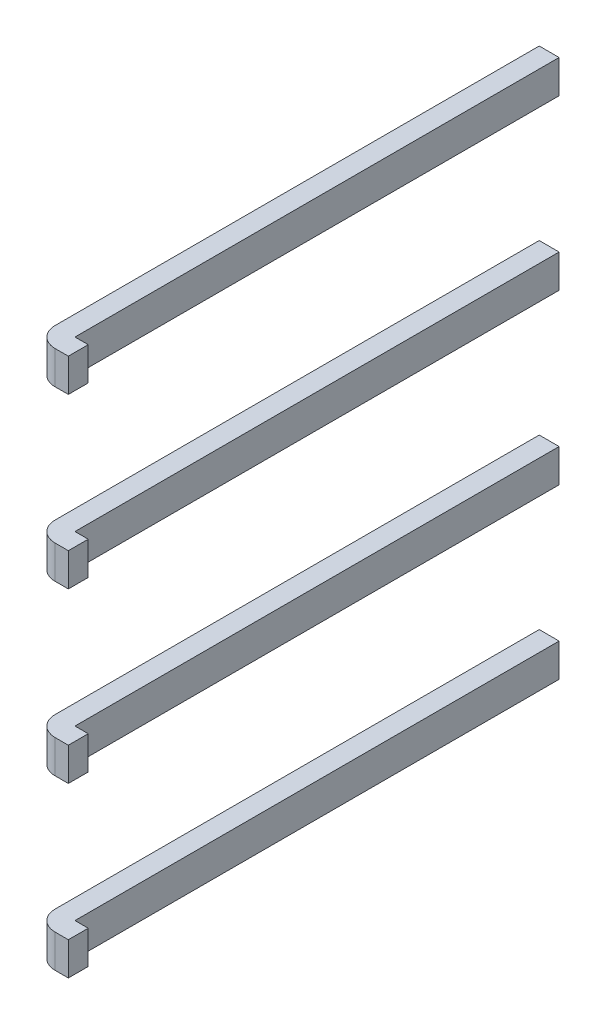
ISO-10303-21;
HEADER;
FILE_DESCRIPTION(('STEP AP214'),'2;1');
FILE_NAME('part.step','',(''),(''),'','','');
FILE_SCHEMA(('AUTOMOTIVE_DESIGN { 1 0 10303 214 1 1 1 1 }'));
ENDSEC;
DATA;
#1=APPLICATION_CONTEXT('core data for automotive mechanical design processes');
#2=APPLICATION_PROTOCOL_DEFINITION('international standard','automotive_design',2000,#1);
#3=PRODUCT_CONTEXT('',#1,'mechanical');
#4=PRODUCT('Part','Part','',(#3));
#5=PRODUCT_RELATED_PRODUCT_CATEGORY('part','',(#4));
#6=PRODUCT_DEFINITION_FORMATION('','',#4);
#7=PRODUCT_DEFINITION_CONTEXT('part definition',#1,'design');
#8=PRODUCT_DEFINITION('design','',#6,#7);
#9=PRODUCT_DEFINITION_SHAPE('','',#8);
#10=(LENGTH_UNIT() NAMED_UNIT(*) SI_UNIT(.MILLI.,.METRE.));
#11=(NAMED_UNIT(*) PLANE_ANGLE_UNIT() SI_UNIT($,.RADIAN.));
#12=(NAMED_UNIT(*) SI_UNIT($,.STERADIAN.) SOLID_ANGLE_UNIT());
#13=UNCERTAINTY_MEASURE_WITH_UNIT(LENGTH_MEASURE(1.E-05),#10,'distance_accuracy_value','');
#14=(GEOMETRIC_REPRESENTATION_CONTEXT(3) GLOBAL_UNCERTAINTY_ASSIGNED_CONTEXT((#13)) GLOBAL_UNIT_ASSIGNED_CONTEXT((#10,
#11,#12)) REPRESENTATION_CONTEXT('',''));
#15=CARTESIAN_POINT('',(0.,0.,0.));
#16=DIRECTION('',(0.,0.,1.));
#17=DIRECTION('',(1.,0.,0.));
#18=AXIS2_PLACEMENT_3D('',#15,#16,#17);
#19=CARTESIAN_POINT('',(-8.,1.27,3.2));
#20=DIRECTION('',(0.,1.034727858951E-13,-1.));
#21=DIRECTION('',(0.,1.,1.034727858951E-13));
#22=AXIS2_PLACEMENT_3D('',#19,#20,#21);
#23=PLANE('',#22);
#24=DIRECTION('',(1.,0.,0.));
#25=VECTOR('',#24,1.);
#26=CARTESIAN_POINT('',(-8.34012345679,0.769999999999616,3.2));
#27=LINE('',#26,#25);
#28=CARTESIAN_POINT('',(-8.,0.769999999999616,3.2));
#29=VERTEX_POINT('',#28);
#30=CARTESIAN_POINT('',(-8.2,0.769999999999793,3.19999999999996));
#31=VERTEX_POINT('',#30);
#32=EDGE_CURVE('P0_E118',#29,#31,#27,.F.);
#33=ORIENTED_EDGE('',*,*,#32,.F.);
#34=DIRECTION('',(0.,1.,0.));
#35=VECTOR('',#34,1.);
#36=CARTESIAN_POINT('',(-8.,1.27,3.2));
#37=LINE('',#36,#35);
#38=CARTESIAN_POINT('',(-8.,1.26999999999974,3.2));
#39=VERTEX_POINT('',#38);
#40=EDGE_CURVE('P0_E94',#29,#39,#37,.T.);
#41=ORIENTED_EDGE('',*,*,#40,.T.);
#42=DIRECTION('',(1.,0.,0.));
#43=VECTOR('',#42,1.);
#44=CARTESIAN_POINT('',(-8.34012345679,1.26999999999962,3.2));
#45=LINE('',#44,#43);
#46=CARTESIAN_POINT('',(-8.2,1.26999999999981,3.2));
#47=VERTEX_POINT('',#46);
#48=EDGE_CURVE('P0_E67',#39,#47,#45,.F.);
#49=ORIENTED_EDGE('',*,*,#48,.T.);
#50=DIRECTION('',(0.,-1.,-1.034727858951E-13));
#51=VECTOR('',#50,1.);
#52=CARTESIAN_POINT('',(-8.2,1.26999999999997,3.2));
#53=LINE('',#52,#51);
#54=EDGE_CURVE('P0_E103',#31,#47,#53,.F.);
#55=ORIENTED_EDGE('',*,*,#54,.F.);
#56=EDGE_LOOP('',(#33,#41,#49,#55));
#57=FACE_BOUND('',#56,.T.);
#58=ADVANCED_FACE('P0_F16',(#57),#23,.F.);
#59=CARTESIAN_POINT('',(-8.2,1.27,-4.4));
#60=DIRECTION('',(-1.,0.,0.));
#61=DIRECTION('',(0.,0.,1.));
#62=AXIS2_PLACEMENT_3D('',#59,#60,#61);
#63=PLANE('',#62);
#64=DIRECTION('',(0.,-1.,-1.034727858951E-13));
#65=VECTOR('',#64,1.);
#66=CARTESIAN_POINT('',(-8.2,1.27,2.9));
#67=LINE('',#66,#65);
#68=CARTESIAN_POINT('',(-8.2,1.26999999999977,2.9));
#69=VERTEX_POINT('',#68);
#70=CARTESIAN_POINT('',(-8.2,0.769999999999647,2.89999999999998));
#71=VERTEX_POINT('',#70);
#72=EDGE_CURVE('P0_E95',#69,#71,#67,.T.);
#73=ORIENTED_EDGE('',*,*,#72,.T.);
#74=DIRECTION('',(0.,1.034762911095E-13,-1.));
#75=VECTOR('',#74,1.);
#76=CARTESIAN_POINT('',(-8.2,0.77,-0.50987654321));
#77=LINE('',#76,#75);
#78=CARTESIAN_POINT('',(-8.2,0.770000000000134,-4.40000000000003));
#79=VERTEX_POINT('',#78);
#80=EDGE_CURVE('P0_E86',#79,#71,#77,.F.);
#81=ORIENTED_EDGE('',*,*,#80,.F.);
#82=DIRECTION('',(0.,1.,0.));
#83=VECTOR('',#82,1.);
#84=CARTESIAN_POINT('',(-8.2,1.27,-4.4));
#85=LINE('',#84,#83);
#86=CARTESIAN_POINT('',(-8.2,1.27000000000013,-4.4));
#87=VERTEX_POINT('',#86);
#88=EDGE_CURVE('P0_E155',#87,#79,#85,.F.);
#89=ORIENTED_EDGE('',*,*,#88,.F.);
#90=DIRECTION('',(0.,1.034762911095E-13,-1.));
#91=VECTOR('',#90,1.);
#92=CARTESIAN_POINT('',(-8.2,1.27,-0.50987654321));
#93=LINE('',#92,#91);
#94=EDGE_CURVE('P0_E112',#87,#69,#93,.F.);
#95=ORIENTED_EDGE('',*,*,#94,.T.);
#96=EDGE_LOOP('',(#73,#81,#89,#95));
#97=FACE_BOUND('',#96,.T.);
#98=ADVANCED_FACE('P0_F163',(#97),#63,.F.);
#99=CARTESIAN_POINT('',(-8.2,1.27,2.9));
#100=DIRECTION('',(0.,-1.034727858951E-13,1.));
#101=DIRECTION('',(0.,-1.,-1.034727858951E-13));
#102=AXIS2_PLACEMENT_3D('',#99,#100,#101);
#103=PLANE('',#102);
#104=DIRECTION('',(0.,1.,0.));
#105=VECTOR('',#104,1.);
#106=CARTESIAN_POINT('',(-8.,1.27,2.9));
#107=LINE('',#106,#105);
#108=CARTESIAN_POINT('',(-8.,1.26999999999991,2.9));
#109=VERTEX_POINT('',#108);
#110=CARTESIAN_POINT('',(-8.,0.769999999999912,2.89999999999997));
#111=VERTEX_POINT('',#110);
#112=EDGE_CURVE('P0_E74',#109,#111,#107,.F.);
#113=ORIENTED_EDGE('',*,*,#112,.T.);
#114=DIRECTION('',(1.,0.,0.));
#115=VECTOR('',#114,1.);
#116=CARTESIAN_POINT('',(-8.34012345679,0.769999999999647,2.9));
#117=LINE('',#116,#115);
#118=EDGE_CURVE('P0_E81',#71,#111,#117,.T.);
#119=ORIENTED_EDGE('',*,*,#118,.F.);
#120=ORIENTED_EDGE('',*,*,#72,.F.);
#121=DIRECTION('',(1.,0.,0.));
#122=VECTOR('',#121,1.);
#123=CARTESIAN_POINT('',(-8.34012345679,1.26999999999965,2.9));
#124=LINE('',#123,#122);
#125=EDGE_CURVE('P0_E93',#69,#109,#124,.T.);
#126=ORIENTED_EDGE('',*,*,#125,.T.);
#127=EDGE_LOOP('',(#113,#119,#120,#126));
#128=FACE_BOUND('',#127,.T.);
#129=ADVANCED_FACE('P0_F91',(#128),#103,.F.);
#130=CARTESIAN_POINT('',(-8.,1.27,2.9));
#131=DIRECTION('',(-1.,0.,0.));
#132=DIRECTION('',(0.,0.,1.));
#133=AXIS2_PLACEMENT_3D('',#130,#131,#132);
#134=PLANE('',#133);
#135=ORIENTED_EDGE('',*,*,#40,.F.);
#136=DIRECTION('',(0.,1.034762911095E-13,-1.));
#137=VECTOR('',#136,1.);
#138=CARTESIAN_POINT('',(-8.,0.77,-0.50987654321));
#139=LINE('',#138,#137);
#140=EDGE_CURVE('P0_E83',#111,#29,#139,.F.);
#141=ORIENTED_EDGE('',*,*,#140,.F.);
#142=ORIENTED_EDGE('',*,*,#112,.F.);
#143=DIRECTION('',(0.,1.034762911095E-13,-1.));
#144=VECTOR('',#143,1.);
#145=CARTESIAN_POINT('',(-8.,1.27,-0.50987654321));
#146=LINE('',#145,#144);
#147=EDGE_CURVE('P0_E111',#109,#39,#146,.F.);
#148=ORIENTED_EDGE('',*,*,#147,.T.);
#149=EDGE_LOOP('',(#135,#141,#142,#148));
#150=FACE_BOUND('',#149,.T.);
#151=ADVANCED_FACE('P0_F97',(#150),#134,.F.);
#152=CARTESIAN_POINT('',(-8.34012345679,1.27,-0.50987654321));
#153=DIRECTION('',(0.,-1.,-1.034762911095E-13));
#154=DIRECTION('',(0.,1.034762911095E-13,-1.));
#155=AXIS2_PLACEMENT_3D('',#152,#153,#154);
#156=PLANE('',#155);
#157=ORIENTED_EDGE('',*,*,#125,.F.);
#158=ORIENTED_EDGE('',*,*,#94,.F.);
#159=DIRECTION('',(1.,0.,0.));
#160=VECTOR('',#159,1.);
#161=CARTESIAN_POINT('',(-8.5,1.27,-4.4));
#162=LINE('',#161,#160);
#163=CARTESIAN_POINT('',(-8.5,1.27,-4.4));
#164=VERTEX_POINT('',#163);
#165=EDGE_CURVE('P0_E99',#87,#164,#162,.F.);
#166=ORIENTED_EDGE('',*,*,#165,.T.);
#167=DIRECTION('',(0.,0.,-1.));
#168=VECTOR('',#167,1.);
#169=CARTESIAN_POINT('',(-8.5,1.27,3.2));
#170=LINE('',#169,#168);
#171=CARTESIAN_POINT('',(-8.5,1.27000000000002,2.9));
#172=VERTEX_POINT('',#171);
#173=EDGE_CURVE('P0_E130',#164,#172,#170,.F.);
#174=ORIENTED_EDGE('',*,*,#173,.T.);
#175=CARTESIAN_POINT('',(-8.2,1.27000000000003,2.9));
#176=DIRECTION('',(0.,-1.,-1.034727858951E-13));
#177=DIRECTION('',(0.,1.034727858951E-13,-1.));
#178=AXIS2_PLACEMENT_3D('',#175,#176,#177);
#179=CIRCLE('',#178,0.3);
#180=EDGE_CURVE('P0_E19',#47,#172,#179,.T.);
#181=ORIENTED_EDGE('',*,*,#180,.F.);
#182=ORIENTED_EDGE('',*,*,#48,.F.);
#183=ORIENTED_EDGE('',*,*,#147,.F.);
#184=EDGE_LOOP('',(#157,#158,#166,#174,#181,#182,#183));
#185=FACE_BOUND('',#184,.T.);
#186=ADVANCED_FACE('P0_F166',(#185),#156,.F.);
#187=CARTESIAN_POINT('',(-8.2,1.27,2.9));
#188=DIRECTION('',(0.,-1.,-1.034727858951E-13));
#189=DIRECTION('',(0.,1.034727858951E-13,-1.));
#190=AXIS2_PLACEMENT_3D('',#187,#188,#189);
#191=CYLINDRICAL_SURFACE('',#190,0.3);
#192=CARTESIAN_POINT('',(-8.2,0.77,2.89999999999995));
#193=DIRECTION('',(0.,-1.,-1.034727858951E-13));
#194=DIRECTION('',(0.,1.034727858951E-13,-1.));
#195=AXIS2_PLACEMENT_3D('',#192,#193,#194);
#196=CIRCLE('',#195,0.3);
#197=CARTESIAN_POINT('',(-8.5,0.77,2.89999999999997));
#198=VERTEX_POINT('',#197);
#199=EDGE_CURVE('P0_E117',#31,#198,#196,.T.);
#200=ORIENTED_EDGE('',*,*,#199,.F.);
#201=ORIENTED_EDGE('',*,*,#54,.T.);
#202=ORIENTED_EDGE('',*,*,#180,.T.);
#203=DIRECTION('',(0.,1.,0.));
#204=VECTOR('',#203,1.);
#205=CARTESIAN_POINT('',(-8.5,1.27,2.9));
#206=LINE('',#205,#204);
#207=EDGE_CURVE('P0_E127',#172,#198,#206,.F.);
#208=ORIENTED_EDGE('',*,*,#207,.T.);
#209=EDGE_LOOP('',(#200,#201,#202,#208));
#210=FACE_BOUND('',#209,.T.);
#211=ADVANCED_FACE('P0_F171',(#210),#191,.T.);
#212=CARTESIAN_POINT('',(-8.34012345679,0.77,-0.50987654321));
#213=DIRECTION('',(0.,-1.,-1.034762911095E-13));
#214=DIRECTION('',(0.,1.034762911095E-13,-1.));
#215=AXIS2_PLACEMENT_3D('',#212,#213,#214);
#216=PLANE('',#215);
#217=ORIENTED_EDGE('',*,*,#118,.T.);
#218=ORIENTED_EDGE('',*,*,#140,.T.);
#219=ORIENTED_EDGE('',*,*,#32,.T.);
#220=ORIENTED_EDGE('',*,*,#199,.T.);
#221=DIRECTION('',(0.,0.,-1.));
#222=VECTOR('',#221,1.);
#223=CARTESIAN_POINT('',(-8.5,0.77,3.2));
#224=LINE('',#223,#222);
#225=CARTESIAN_POINT('',(-8.5,0.77,-4.40000000000003));
#226=VERTEX_POINT('',#225);
#227=EDGE_CURVE('P0_E25',#198,#226,#224,.T.);
#228=ORIENTED_EDGE('',*,*,#227,.T.);
#229=DIRECTION('',(1.,0.,0.));
#230=VECTOR('',#229,1.);
#231=CARTESIAN_POINT('',(-8.5,0.77,-4.40000000000005));
#232=LINE('',#231,#230);
#233=EDGE_CURVE('P0_E33',#226,#79,#232,.T.);
#234=ORIENTED_EDGE('',*,*,#233,.T.);
#235=ORIENTED_EDGE('',*,*,#80,.T.);
#236=EDGE_LOOP('',(#217,#218,#219,#220,#228,#234,#235));
#237=FACE_BOUND('',#236,.T.);
#238=ADVANCED_FACE('P0_F82',(#237),#216,.T.);
#239=CARTESIAN_POINT('',(-8.5,1.27,-4.4));
#240=DIRECTION('',(0.,-1.034727858951E-13,1.));
#241=DIRECTION('',(0.,-1.,-1.034727858951E-13));
#242=AXIS2_PLACEMENT_3D('',#239,#240,#241);
#243=PLANE('',#242);
#244=ORIENTED_EDGE('',*,*,#88,.T.);
#245=ORIENTED_EDGE('',*,*,#233,.F.);
#246=DIRECTION('',(0.,1.,0.));
#247=VECTOR('',#246,1.);
#248=CARTESIAN_POINT('',(-8.5,1.27,-4.4));
#249=LINE('',#248,#247);
#250=EDGE_CURVE('P0_E11',#226,#164,#249,.T.);
#251=ORIENTED_EDGE('',*,*,#250,.T.);
#252=ORIENTED_EDGE('',*,*,#165,.F.);
#253=EDGE_LOOP('',(#244,#245,#251,#252));
#254=FACE_BOUND('',#253,.T.);
#255=ADVANCED_FACE('P0_F176',(#254),#243,.F.);
#256=CARTESIAN_POINT('',(-8.5,1.27,3.2));
#257=DIRECTION('',(1.,0.,0.));
#258=DIRECTION('',(0.,0.,-1.));
#259=AXIS2_PLACEMENT_3D('',#256,#257,#258);
#260=PLANE('',#259);
#261=ORIENTED_EDGE('',*,*,#227,.F.);
#262=ORIENTED_EDGE('',*,*,#207,.F.);
#263=ORIENTED_EDGE('',*,*,#173,.F.);
#264=ORIENTED_EDGE('',*,*,#250,.F.);
#265=EDGE_LOOP('',(#261,#262,#263,#264));
#266=FACE_BOUND('',#265,.T.);
#267=ADVANCED_FACE('P0_F175',(#266),#260,.F.);
#268=CLOSED_SHELL('',(#58,#98,#129,#151,#186,#211,#238,#255,#267));
#269=MANIFOLD_SOLID_BREP('P0_B1',#268);
#270=CARTESIAN_POINT('',(-8.,-3.81,3.2));
#271=DIRECTION('',(0.,1.034727858951E-13,-1.));
#272=DIRECTION('',(0.,1.,1.034727858951E-13));
#273=AXIS2_PLACEMENT_3D('',#270,#271,#272);
#274=PLANE('',#273);
#275=DIRECTION('',(1.,0.,0.));
#276=VECTOR('',#275,1.);
#277=CARTESIAN_POINT('',(-8.34012345679,-4.31000000000038,3.2));
#278=LINE('',#277,#276);
#279=CARTESIAN_POINT('',(-8.,-4.31000000000038,3.2));
#280=VERTEX_POINT('',#279);
#281=CARTESIAN_POINT('',(-8.2,-4.31000000000021,3.19999999999996));
#282=VERTEX_POINT('',#281);
#283=EDGE_CURVE('P1_E118',#280,#282,#278,.F.);
#284=ORIENTED_EDGE('',*,*,#283,.F.);
#285=DIRECTION('',(0.,1.,0.));
#286=VECTOR('',#285,1.);
#287=CARTESIAN_POINT('',(-8.,-3.81,3.2));
#288=LINE('',#287,#286);
#289=CARTESIAN_POINT('',(-8.,-3.81000000000026,3.2));
#290=VERTEX_POINT('',#289);
#291=EDGE_CURVE('P1_E94',#280,#290,#288,.T.);
#292=ORIENTED_EDGE('',*,*,#291,.T.);
#293=DIRECTION('',(1.,0.,0.));
#294=VECTOR('',#293,1.);
#295=CARTESIAN_POINT('',(-8.34012345679,-3.81000000000038,3.2));
#296=LINE('',#295,#294);
#297=CARTESIAN_POINT('',(-8.2,-3.81000000000019,3.2));
#298=VERTEX_POINT('',#297);
#299=EDGE_CURVE('P1_E67',#290,#298,#296,.F.);
#300=ORIENTED_EDGE('',*,*,#299,.T.);
#301=DIRECTION('',(0.,-1.,-1.034727858951E-13));
#302=VECTOR('',#301,1.);
#303=CARTESIAN_POINT('',(-8.2,-3.81000000000003,3.2));
#304=LINE('',#303,#302);
#305=EDGE_CURVE('P1_E103',#282,#298,#304,.F.);
#306=ORIENTED_EDGE('',*,*,#305,.F.);
#307=EDGE_LOOP('',(#284,#292,#300,#306));
#308=FACE_BOUND('',#307,.T.);
#309=ADVANCED_FACE('P1_F16',(#308),#274,.F.);
#310=CARTESIAN_POINT('',(-8.2,-3.81,-4.4));
#311=DIRECTION('',(-1.,0.,0.));
#312=DIRECTION('',(0.,0.,1.));
#313=AXIS2_PLACEMENT_3D('',#310,#311,#312);
#314=PLANE('',#313);
#315=DIRECTION('',(0.,-1.,-1.034727858951E-13));
#316=VECTOR('',#315,1.);
#317=CARTESIAN_POINT('',(-8.2,-3.81,2.9));
#318=LINE('',#317,#316);
#319=CARTESIAN_POINT('',(-8.2,-3.81000000000024,2.9));
#320=VERTEX_POINT('',#319);
#321=CARTESIAN_POINT('',(-8.2,-4.31000000000035,2.89999999999998));
#322=VERTEX_POINT('',#321);
#323=EDGE_CURVE('P1_E95',#320,#322,#318,.T.);
#324=ORIENTED_EDGE('',*,*,#323,.T.);
#325=DIRECTION('',(0.,1.034762911095E-13,-1.));
#326=VECTOR('',#325,1.);
#327=CARTESIAN_POINT('',(-8.2,-4.31,-0.50987654321));
#328=LINE('',#327,#326);
#329=CARTESIAN_POINT('',(-8.2,-4.30999999999987,-4.40000000000003));
#330=VERTEX_POINT('',#329);
#331=EDGE_CURVE('P1_E86',#330,#322,#328,.F.);
#332=ORIENTED_EDGE('',*,*,#331,.F.);
#333=DIRECTION('',(0.,1.,0.));
#334=VECTOR('',#333,1.);
#335=CARTESIAN_POINT('',(-8.2,-3.81,-4.4));
#336=LINE('',#335,#334);
#337=CARTESIAN_POINT('',(-8.2,-3.80999999999987,-4.4));
#338=VERTEX_POINT('',#337);
#339=EDGE_CURVE('P1_E155',#338,#330,#336,.F.);
#340=ORIENTED_EDGE('',*,*,#339,.F.);
#341=DIRECTION('',(0.,1.034762911095E-13,-1.));
#342=VECTOR('',#341,1.);
#343=CARTESIAN_POINT('',(-8.2,-3.81,-0.50987654321));
#344=LINE('',#343,#342);
#345=EDGE_CURVE('P1_E112',#338,#320,#344,.F.);
#346=ORIENTED_EDGE('',*,*,#345,.T.);
#347=EDGE_LOOP('',(#324,#332,#340,#346));
#348=FACE_BOUND('',#347,.T.);
#349=ADVANCED_FACE('P1_F163',(#348),#314,.F.);
#350=CARTESIAN_POINT('',(-8.2,-3.81,2.9));
#351=DIRECTION('',(0.,-1.034727858951E-13,1.));
#352=DIRECTION('',(0.,-1.,-1.034727858951E-13));
#353=AXIS2_PLACEMENT_3D('',#350,#351,#352);
#354=PLANE('',#353);
#355=DIRECTION('',(0.,1.,0.));
#356=VECTOR('',#355,1.);
#357=CARTESIAN_POINT('',(-8.,-3.81,2.9));
#358=LINE('',#357,#356);
#359=CARTESIAN_POINT('',(-8.,-3.81000000000009,2.9));
#360=VERTEX_POINT('',#359);
#361=CARTESIAN_POINT('',(-8.,-4.31000000000009,2.89999999999997));
#362=VERTEX_POINT('',#361);
#363=EDGE_CURVE('P1_E74',#360,#362,#358,.F.);
#364=ORIENTED_EDGE('',*,*,#363,.T.);
#365=DIRECTION('',(1.,0.,0.));
#366=VECTOR('',#365,1.);
#367=CARTESIAN_POINT('',(-8.34012345679,-4.31000000000035,2.9));
#368=LINE('',#367,#366);
#369=EDGE_CURVE('P1_E81',#322,#362,#368,.T.);
#370=ORIENTED_EDGE('',*,*,#369,.F.);
#371=ORIENTED_EDGE('',*,*,#323,.F.);
#372=DIRECTION('',(1.,0.,0.));
#373=VECTOR('',#372,1.);
#374=CARTESIAN_POINT('',(-8.34012345679,-3.81000000000035,2.9));
#375=LINE('',#374,#373);
#376=EDGE_CURVE('P1_E93',#320,#360,#375,.T.);
#377=ORIENTED_EDGE('',*,*,#376,.T.);
#378=EDGE_LOOP('',(#364,#370,#371,#377));
#379=FACE_BOUND('',#378,.T.);
#380=ADVANCED_FACE('P1_F91',(#379),#354,.F.);
#381=CARTESIAN_POINT('',(-8.,-3.81,2.9));
#382=DIRECTION('',(-1.,0.,0.));
#383=DIRECTION('',(0.,0.,1.));
#384=AXIS2_PLACEMENT_3D('',#381,#382,#383);
#385=PLANE('',#384);
#386=ORIENTED_EDGE('',*,*,#291,.F.);
#387=DIRECTION('',(0.,1.034762911095E-13,-1.));
#388=VECTOR('',#387,1.);
#389=CARTESIAN_POINT('',(-8.,-4.31,-0.50987654321));
#390=LINE('',#389,#388);
#391=EDGE_CURVE('P1_E83',#362,#280,#390,.F.);
#392=ORIENTED_EDGE('',*,*,#391,.F.);
#393=ORIENTED_EDGE('',*,*,#363,.F.);
#394=DIRECTION('',(0.,1.034762911095E-13,-1.));
#395=VECTOR('',#394,1.);
#396=CARTESIAN_POINT('',(-8.,-3.81,-0.50987654321));
#397=LINE('',#396,#395);
#398=EDGE_CURVE('P1_E111',#360,#290,#397,.F.);
#399=ORIENTED_EDGE('',*,*,#398,.T.);
#400=EDGE_LOOP('',(#386,#392,#393,#399));
#401=FACE_BOUND('',#400,.T.);
#402=ADVANCED_FACE('P1_F97',(#401),#385,.F.);
#403=CARTESIAN_POINT('',(-8.34012345679,-3.81,-0.50987654321));
#404=DIRECTION('',(0.,-1.,-1.034762911095E-13));
#405=DIRECTION('',(0.,1.034762911095E-13,-1.));
#406=AXIS2_PLACEMENT_3D('',#403,#404,#405);
#407=PLANE('',#406);
#408=ORIENTED_EDGE('',*,*,#376,.F.);
#409=ORIENTED_EDGE('',*,*,#345,.F.);
#410=DIRECTION('',(1.,0.,0.));
#411=VECTOR('',#410,1.);
#412=CARTESIAN_POINT('',(-8.5,-3.81,-4.4));
#413=LINE('',#412,#411);
#414=CARTESIAN_POINT('',(-8.5,-3.81,-4.4));
#415=VERTEX_POINT('',#414);
#416=EDGE_CURVE('P1_E99',#338,#415,#413,.F.);
#417=ORIENTED_EDGE('',*,*,#416,.T.);
#418=DIRECTION('',(0.,0.,-1.));
#419=VECTOR('',#418,1.);
#420=CARTESIAN_POINT('',(-8.5,-3.81,3.2));
#421=LINE('',#420,#419);
#422=CARTESIAN_POINT('',(-8.5,-3.80999999999998,2.9));
#423=VERTEX_POINT('',#422);
#424=EDGE_CURVE('P1_E130',#415,#423,#421,.F.);
#425=ORIENTED_EDGE('',*,*,#424,.T.);
#426=CARTESIAN_POINT('',(-8.2,-3.80999999999997,2.9));
#427=DIRECTION('',(0.,-1.,-1.034727858951E-13));
#428=DIRECTION('',(0.,1.034727858951E-13,-1.));
#429=AXIS2_PLACEMENT_3D('',#426,#427,#428);
#430=CIRCLE('',#429,0.3);
#431=EDGE_CURVE('P1_E19',#298,#423,#430,.T.);
#432=ORIENTED_EDGE('',*,*,#431,.F.);
#433=ORIENTED_EDGE('',*,*,#299,.F.);
#434=ORIENTED_EDGE('',*,*,#398,.F.);
#435=EDGE_LOOP('',(#408,#409,#417,#425,#432,#433,#434));
#436=FACE_BOUND('',#435,.T.);
#437=ADVANCED_FACE('P1_F166',(#436),#407,.F.);
#438=CARTESIAN_POINT('',(-8.2,-3.81,2.9));
#439=DIRECTION('',(0.,-1.,-1.034727858951E-13));
#440=DIRECTION('',(0.,1.034727858951E-13,-1.));
#441=AXIS2_PLACEMENT_3D('',#438,#439,#440);
#442=CYLINDRICAL_SURFACE('',#441,0.3);
#443=CARTESIAN_POINT('',(-8.2,-4.31,2.89999999999995));
#444=DIRECTION('',(0.,-1.,-1.034727858951E-13));
#445=DIRECTION('',(0.,1.034727858951E-13,-1.));
#446=AXIS2_PLACEMENT_3D('',#443,#444,#445);
#447=CIRCLE('',#446,0.3);
#448=CARTESIAN_POINT('',(-8.5,-4.31,2.89999999999997));
#449=VERTEX_POINT('',#448);
#450=EDGE_CURVE('P1_E117',#282,#449,#447,.T.);
#451=ORIENTED_EDGE('',*,*,#450,.F.);
#452=ORIENTED_EDGE('',*,*,#305,.T.);
#453=ORIENTED_EDGE('',*,*,#431,.T.);
#454=DIRECTION('',(0.,1.,0.));
#455=VECTOR('',#454,1.);
#456=CARTESIAN_POINT('',(-8.5,-3.81,2.9));
#457=LINE('',#456,#455);
#458=EDGE_CURVE('P1_E127',#423,#449,#457,.F.);
#459=ORIENTED_EDGE('',*,*,#458,.T.);
#460=EDGE_LOOP('',(#451,#452,#453,#459));
#461=FACE_BOUND('',#460,.T.);
#462=ADVANCED_FACE('P1_F171',(#461),#442,.T.);
#463=CARTESIAN_POINT('',(-8.34012345679,-4.31,-0.50987654321));
#464=DIRECTION('',(0.,-1.,-1.034762911095E-13));
#465=DIRECTION('',(0.,1.034762911095E-13,-1.));
#466=AXIS2_PLACEMENT_3D('',#463,#464,#465);
#467=PLANE('',#466);
#468=ORIENTED_EDGE('',*,*,#369,.T.);
#469=ORIENTED_EDGE('',*,*,#391,.T.);
#470=ORIENTED_EDGE('',*,*,#283,.T.);
#471=ORIENTED_EDGE('',*,*,#450,.T.);
#472=DIRECTION('',(0.,0.,-1.));
#473=VECTOR('',#472,1.);
#474=CARTESIAN_POINT('',(-8.5,-4.31,3.2));
#475=LINE('',#474,#473);
#476=CARTESIAN_POINT('',(-8.5,-4.31,-4.40000000000003));
#477=VERTEX_POINT('',#476);
#478=EDGE_CURVE('P1_E25',#449,#477,#475,.T.);
#479=ORIENTED_EDGE('',*,*,#478,.T.);
#480=DIRECTION('',(1.,0.,0.));
#481=VECTOR('',#480,1.);
#482=CARTESIAN_POINT('',(-8.5,-4.31,-4.40000000000005));
#483=LINE('',#482,#481);
#484=EDGE_CURVE('P1_E33',#477,#330,#483,.T.);
#485=ORIENTED_EDGE('',*,*,#484,.T.);
#486=ORIENTED_EDGE('',*,*,#331,.T.);
#487=EDGE_LOOP('',(#468,#469,#470,#471,#479,#485,#486));
#488=FACE_BOUND('',#487,.T.);
#489=ADVANCED_FACE('P1_F82',(#488),#467,.T.);
#490=CARTESIAN_POINT('',(-8.5,-3.81,-4.4));
#491=DIRECTION('',(0.,-1.034727858951E-13,1.));
#492=DIRECTION('',(0.,-1.,-1.034727858951E-13));
#493=AXIS2_PLACEMENT_3D('',#490,#491,#492);
#494=PLANE('',#493);
#495=ORIENTED_EDGE('',*,*,#339,.T.);
#496=ORIENTED_EDGE('',*,*,#484,.F.);
#497=DIRECTION('',(0.,1.,0.));
#498=VECTOR('',#497,1.);
#499=CARTESIAN_POINT('',(-8.5,-3.81,-4.4));
#500=LINE('',#499,#498);
#501=EDGE_CURVE('P1_E11',#477,#415,#500,.T.);
#502=ORIENTED_EDGE('',*,*,#501,.T.);
#503=ORIENTED_EDGE('',*,*,#416,.F.);
#504=EDGE_LOOP('',(#495,#496,#502,#503));
#505=FACE_BOUND('',#504,.T.);
#506=ADVANCED_FACE('P1_F176',(#505),#494,.F.);
#507=CARTESIAN_POINT('',(-8.5,-3.81,3.2));
#508=DIRECTION('',(1.,0.,0.));
#509=DIRECTION('',(0.,0.,-1.));
#510=AXIS2_PLACEMENT_3D('',#507,#508,#509);
#511=PLANE('',#510);
#512=ORIENTED_EDGE('',*,*,#478,.F.);
#513=ORIENTED_EDGE('',*,*,#458,.F.);
#514=ORIENTED_EDGE('',*,*,#424,.F.);
#515=ORIENTED_EDGE('',*,*,#501,.F.);
#516=EDGE_LOOP('',(#512,#513,#514,#515));
#517=FACE_BOUND('',#516,.T.);
#518=ADVANCED_FACE('P1_F175',(#517),#511,.F.);
#519=CLOSED_SHELL('',(#309,#349,#380,#402,#437,#462,#489,#506,#518));
#520=MANIFOLD_SOLID_BREP('P1_B1',#519);
#521=CARTESIAN_POINT('',(-8.,-1.27,3.2));
#522=DIRECTION('',(0.,1.034727858951E-13,-1.));
#523=DIRECTION('',(0.,1.,1.034727858951E-13));
#524=AXIS2_PLACEMENT_3D('',#521,#522,#523);
#525=PLANE('',#524);
#526=DIRECTION('',(1.,0.,0.));
#527=VECTOR('',#526,1.);
#528=CARTESIAN_POINT('',(-8.34012345679,-1.77000000000038,3.2));
#529=LINE('',#528,#527);
#530=CARTESIAN_POINT('',(-8.,-1.77000000000038,3.2));
#531=VERTEX_POINT('',#530);
#532=CARTESIAN_POINT('',(-8.2,-1.77000000000021,3.19999999999996));
#533=VERTEX_POINT('',#532);
#534=EDGE_CURVE('P2_E118',#531,#533,#529,.F.);
#535=ORIENTED_EDGE('',*,*,#534,.F.);
#536=DIRECTION('',(0.,1.,0.));
#537=VECTOR('',#536,1.);
#538=CARTESIAN_POINT('',(-8.,-1.27,3.2));
#539=LINE('',#538,#537);
#540=CARTESIAN_POINT('',(-8.,-1.27000000000026,3.2));
#541=VERTEX_POINT('',#540);
#542=EDGE_CURVE('P2_E94',#531,#541,#539,.T.);
#543=ORIENTED_EDGE('',*,*,#542,.T.);
#544=DIRECTION('',(1.,0.,0.));
#545=VECTOR('',#544,1.);
#546=CARTESIAN_POINT('',(-8.34012345679,-1.27000000000038,3.2));
#547=LINE('',#546,#545);
#548=CARTESIAN_POINT('',(-8.2,-1.27000000000019,3.2));
#549=VERTEX_POINT('',#548);
#550=EDGE_CURVE('P2_E67',#541,#549,#547,.F.);
#551=ORIENTED_EDGE('',*,*,#550,.T.);
#552=DIRECTION('',(0.,-1.,-1.034727858951E-13));
#553=VECTOR('',#552,1.);
#554=CARTESIAN_POINT('',(-8.2,-1.27000000000003,3.2));
#555=LINE('',#554,#553);
#556=EDGE_CURVE('P2_E103',#533,#549,#555,.F.);
#557=ORIENTED_EDGE('',*,*,#556,.F.);
#558=EDGE_LOOP('',(#535,#543,#551,#557));
#559=FACE_BOUND('',#558,.T.);
#560=ADVANCED_FACE('P2_F16',(#559),#525,.F.);
#561=CARTESIAN_POINT('',(-8.2,-1.27,-4.4));
#562=DIRECTION('',(-1.,0.,0.));
#563=DIRECTION('',(0.,0.,1.));
#564=AXIS2_PLACEMENT_3D('',#561,#562,#563);
#565=PLANE('',#564);
#566=DIRECTION('',(0.,-1.,-1.034727858951E-13));
#567=VECTOR('',#566,1.);
#568=CARTESIAN_POINT('',(-8.2,-1.27,2.9));
#569=LINE('',#568,#567);
#570=CARTESIAN_POINT('',(-8.2,-1.27000000000024,2.9));
#571=VERTEX_POINT('',#570);
#572=CARTESIAN_POINT('',(-8.2,-1.77000000000035,2.89999999999998));
#573=VERTEX_POINT('',#572);
#574=EDGE_CURVE('P2_E95',#571,#573,#569,.T.);
#575=ORIENTED_EDGE('',*,*,#574,.T.);
#576=DIRECTION('',(0.,1.034762911095E-13,-1.));
#577=VECTOR('',#576,1.);
#578=CARTESIAN_POINT('',(-8.2,-1.77,-0.50987654321));
#579=LINE('',#578,#577);
#580=CARTESIAN_POINT('',(-8.2,-1.76999999999987,-4.40000000000003));
#581=VERTEX_POINT('',#580);
#582=EDGE_CURVE('P2_E86',#581,#573,#579,.F.);
#583=ORIENTED_EDGE('',*,*,#582,.F.);
#584=DIRECTION('',(0.,1.,0.));
#585=VECTOR('',#584,1.);
#586=CARTESIAN_POINT('',(-8.2,-1.27,-4.4));
#587=LINE('',#586,#585);
#588=CARTESIAN_POINT('',(-8.2,-1.26999999999987,-4.4));
#589=VERTEX_POINT('',#588);
#590=EDGE_CURVE('P2_E155',#589,#581,#587,.F.);
#591=ORIENTED_EDGE('',*,*,#590,.F.);
#592=DIRECTION('',(0.,1.034762911095E-13,-1.));
#593=VECTOR('',#592,1.);
#594=CARTESIAN_POINT('',(-8.2,-1.27,-0.50987654321));
#595=LINE('',#594,#593);
#596=EDGE_CURVE('P2_E112',#589,#571,#595,.F.);
#597=ORIENTED_EDGE('',*,*,#596,.T.);
#598=EDGE_LOOP('',(#575,#583,#591,#597));
#599=FACE_BOUND('',#598,.T.);
#600=ADVANCED_FACE('P2_F163',(#599),#565,.F.);
#601=CARTESIAN_POINT('',(-8.2,-1.27,2.9));
#602=DIRECTION('',(0.,-1.034727858951E-13,1.));
#603=DIRECTION('',(0.,-1.,-1.034727858951E-13));
#604=AXIS2_PLACEMENT_3D('',#601,#602,#603);
#605=PLANE('',#604);
#606=DIRECTION('',(0.,1.,0.));
#607=VECTOR('',#606,1.);
#608=CARTESIAN_POINT('',(-8.,-1.27,2.9));
#609=LINE('',#608,#607);
#610=CARTESIAN_POINT('',(-8.,-1.27000000000009,2.9));
#611=VERTEX_POINT('',#610);
#612=CARTESIAN_POINT('',(-8.,-1.77000000000009,2.89999999999997));
#613=VERTEX_POINT('',#612);
#614=EDGE_CURVE('P2_E74',#611,#613,#609,.F.);
#615=ORIENTED_EDGE('',*,*,#614,.T.);
#616=DIRECTION('',(1.,0.,0.));
#617=VECTOR('',#616,1.);
#618=CARTESIAN_POINT('',(-8.34012345679,-1.77000000000035,2.9));
#619=LINE('',#618,#617);
#620=EDGE_CURVE('P2_E81',#573,#613,#619,.T.);
#621=ORIENTED_EDGE('',*,*,#620,.F.);
#622=ORIENTED_EDGE('',*,*,#574,.F.);
#623=DIRECTION('',(1.,0.,0.));
#624=VECTOR('',#623,1.);
#625=CARTESIAN_POINT('',(-8.34012345679,-1.27000000000035,2.9));
#626=LINE('',#625,#624);
#627=EDGE_CURVE('P2_E93',#571,#611,#626,.T.);
#628=ORIENTED_EDGE('',*,*,#627,.T.);
#629=EDGE_LOOP('',(#615,#621,#622,#628));
#630=FACE_BOUND('',#629,.T.);
#631=ADVANCED_FACE('P2_F91',(#630),#605,.F.);
#632=CARTESIAN_POINT('',(-8.,-1.27,2.9));
#633=DIRECTION('',(-1.,0.,0.));
#634=DIRECTION('',(0.,0.,1.));
#635=AXIS2_PLACEMENT_3D('',#632,#633,#634);
#636=PLANE('',#635);
#637=ORIENTED_EDGE('',*,*,#542,.F.);
#638=DIRECTION('',(0.,1.034762911095E-13,-1.));
#639=VECTOR('',#638,1.);
#640=CARTESIAN_POINT('',(-8.,-1.77,-0.50987654321));
#641=LINE('',#640,#639);
#642=EDGE_CURVE('P2_E83',#613,#531,#641,.F.);
#643=ORIENTED_EDGE('',*,*,#642,.F.);
#644=ORIENTED_EDGE('',*,*,#614,.F.);
#645=DIRECTION('',(0.,1.034762911095E-13,-1.));
#646=VECTOR('',#645,1.);
#647=CARTESIAN_POINT('',(-8.,-1.27,-0.50987654321));
#648=LINE('',#647,#646);
#649=EDGE_CURVE('P2_E111',#611,#541,#648,.F.);
#650=ORIENTED_EDGE('',*,*,#649,.T.);
#651=EDGE_LOOP('',(#637,#643,#644,#650));
#652=FACE_BOUND('',#651,.T.);
#653=ADVANCED_FACE('P2_F97',(#652),#636,.F.);
#654=CARTESIAN_POINT('',(-8.34012345679,-1.27,-0.50987654321));
#655=DIRECTION('',(0.,-1.,-1.034762911095E-13));
#656=DIRECTION('',(0.,1.034762911095E-13,-1.));
#657=AXIS2_PLACEMENT_3D('',#654,#655,#656);
#658=PLANE('',#657);
#659=ORIENTED_EDGE('',*,*,#627,.F.);
#660=ORIENTED_EDGE('',*,*,#596,.F.);
#661=DIRECTION('',(1.,0.,0.));
#662=VECTOR('',#661,1.);
#663=CARTESIAN_POINT('',(-8.5,-1.27,-4.4));
#664=LINE('',#663,#662);
#665=CARTESIAN_POINT('',(-8.5,-1.27,-4.4));
#666=VERTEX_POINT('',#665);
#667=EDGE_CURVE('P2_E99',#589,#666,#664,.F.);
#668=ORIENTED_EDGE('',*,*,#667,.T.);
#669=DIRECTION('',(0.,0.,-1.));
#670=VECTOR('',#669,1.);
#671=CARTESIAN_POINT('',(-8.5,-1.27,3.2));
#672=LINE('',#671,#670);
#673=CARTESIAN_POINT('',(-8.5,-1.26999999999998,2.9));
#674=VERTEX_POINT('',#673);
#675=EDGE_CURVE('P2_E130',#666,#674,#672,.F.);
#676=ORIENTED_EDGE('',*,*,#675,.T.);
#677=CARTESIAN_POINT('',(-8.2,-1.26999999999997,2.9));
#678=DIRECTION('',(0.,-1.,-1.034727858951E-13));
#679=DIRECTION('',(0.,1.034727858951E-13,-1.));
#680=AXIS2_PLACEMENT_3D('',#677,#678,#679);
#681=CIRCLE('',#680,0.3);
#682=EDGE_CURVE('P2_E19',#549,#674,#681,.T.);
#683=ORIENTED_EDGE('',*,*,#682,.F.);
#684=ORIENTED_EDGE('',*,*,#550,.F.);
#685=ORIENTED_EDGE('',*,*,#649,.F.);
#686=EDGE_LOOP('',(#659,#660,#668,#676,#683,#684,#685));
#687=FACE_BOUND('',#686,.T.);
#688=ADVANCED_FACE('P2_F166',(#687),#658,.F.);
#689=CARTESIAN_POINT('',(-8.2,-1.27,2.9));
#690=DIRECTION('',(0.,-1.,-1.034727858951E-13));
#691=DIRECTION('',(0.,1.034727858951E-13,-1.));
#692=AXIS2_PLACEMENT_3D('',#689,#690,#691);
#693=CYLINDRICAL_SURFACE('',#692,0.3);
#694=CARTESIAN_POINT('',(-8.2,-1.77,2.89999999999995));
#695=DIRECTION('',(0.,-1.,-1.034727858951E-13));
#696=DIRECTION('',(0.,1.034727858951E-13,-1.));
#697=AXIS2_PLACEMENT_3D('',#694,#695,#696);
#698=CIRCLE('',#697,0.3);
#699=CARTESIAN_POINT('',(-8.5,-1.77,2.89999999999997));
#700=VERTEX_POINT('',#699);
#701=EDGE_CURVE('P2_E117',#533,#700,#698,.T.);
#702=ORIENTED_EDGE('',*,*,#701,.F.);
#703=ORIENTED_EDGE('',*,*,#556,.T.);
#704=ORIENTED_EDGE('',*,*,#682,.T.);
#705=DIRECTION('',(0.,1.,0.));
#706=VECTOR('',#705,1.);
#707=CARTESIAN_POINT('',(-8.5,-1.27,2.9));
#708=LINE('',#707,#706);
#709=EDGE_CURVE('P2_E127',#674,#700,#708,.F.);
#710=ORIENTED_EDGE('',*,*,#709,.T.);
#711=EDGE_LOOP('',(#702,#703,#704,#710));
#712=FACE_BOUND('',#711,.T.);
#713=ADVANCED_FACE('P2_F171',(#712),#693,.T.);
#714=CARTESIAN_POINT('',(-8.34012345679,-1.77,-0.50987654321));
#715=DIRECTION('',(0.,-1.,-1.034762911095E-13));
#716=DIRECTION('',(0.,1.034762911095E-13,-1.));
#717=AXIS2_PLACEMENT_3D('',#714,#715,#716);
#718=PLANE('',#717);
#719=ORIENTED_EDGE('',*,*,#620,.T.);
#720=ORIENTED_EDGE('',*,*,#642,.T.);
#721=ORIENTED_EDGE('',*,*,#534,.T.);
#722=ORIENTED_EDGE('',*,*,#701,.T.);
#723=DIRECTION('',(0.,0.,-1.));
#724=VECTOR('',#723,1.);
#725=CARTESIAN_POINT('',(-8.5,-1.77,3.2));
#726=LINE('',#725,#724);
#727=CARTESIAN_POINT('',(-8.5,-1.77,-4.40000000000003));
#728=VERTEX_POINT('',#727);
#729=EDGE_CURVE('P2_E25',#700,#728,#726,.T.);
#730=ORIENTED_EDGE('',*,*,#729,.T.);
#731=DIRECTION('',(1.,0.,0.));
#732=VECTOR('',#731,1.);
#733=CARTESIAN_POINT('',(-8.5,-1.77,-4.40000000000005));
#734=LINE('',#733,#732);
#735=EDGE_CURVE('P2_E33',#728,#581,#734,.T.);
#736=ORIENTED_EDGE('',*,*,#735,.T.);
#737=ORIENTED_EDGE('',*,*,#582,.T.);
#738=EDGE_LOOP('',(#719,#720,#721,#722,#730,#736,#737));
#739=FACE_BOUND('',#738,.T.);
#740=ADVANCED_FACE('P2_F82',(#739),#718,.T.);
#741=CARTESIAN_POINT('',(-8.5,-1.27,-4.4));
#742=DIRECTION('',(0.,-1.034727858951E-13,1.));
#743=DIRECTION('',(0.,-1.,-1.034727858951E-13));
#744=AXIS2_PLACEMENT_3D('',#741,#742,#743);
#745=PLANE('',#744);
#746=ORIENTED_EDGE('',*,*,#590,.T.);
#747=ORIENTED_EDGE('',*,*,#735,.F.);
#748=DIRECTION('',(0.,1.,0.));
#749=VECTOR('',#748,1.);
#750=CARTESIAN_POINT('',(-8.5,-1.27,-4.4));
#751=LINE('',#750,#749);
#752=EDGE_CURVE('P2_E11',#728,#666,#751,.T.);
#753=ORIENTED_EDGE('',*,*,#752,.T.);
#754=ORIENTED_EDGE('',*,*,#667,.F.);
#755=EDGE_LOOP('',(#746,#747,#753,#754));
#756=FACE_BOUND('',#755,.T.);
#757=ADVANCED_FACE('P2_F176',(#756),#745,.F.);
#758=CARTESIAN_POINT('',(-8.5,-1.27,3.2));
#759=DIRECTION('',(1.,0.,0.));
#760=DIRECTION('',(0.,0.,-1.));
#761=AXIS2_PLACEMENT_3D('',#758,#759,#760);
#762=PLANE('',#761);
#763=ORIENTED_EDGE('',*,*,#729,.F.);
#764=ORIENTED_EDGE('',*,*,#709,.F.);
#765=ORIENTED_EDGE('',*,*,#675,.F.);
#766=ORIENTED_EDGE('',*,*,#752,.F.);
#767=EDGE_LOOP('',(#763,#764,#765,#766));
#768=FACE_BOUND('',#767,.T.);
#769=ADVANCED_FACE('P2_F175',(#768),#762,.F.);
#770=CLOSED_SHELL('',(#560,#600,#631,#653,#688,#713,#740,#757,#769));
#771=MANIFOLD_SOLID_BREP('P2_B1',#770);
#772=CARTESIAN_POINT('',(-8.,3.81,3.2));
#773=DIRECTION('',(0.,1.034727858951E-13,-1.));
#774=DIRECTION('',(0.,1.,1.034727858951E-13));
#775=AXIS2_PLACEMENT_3D('',#772,#773,#774);
#776=PLANE('',#775);
#777=DIRECTION('',(1.,0.,0.));
#778=VECTOR('',#777,1.);
#779=CARTESIAN_POINT('',(-8.34012345679,3.30999999999962,3.2));
#780=LINE('',#779,#778);
#781=CARTESIAN_POINT('',(-8.,3.30999999999962,3.2));
#782=VERTEX_POINT('',#781);
#783=CARTESIAN_POINT('',(-8.2,3.30999999999979,3.19999999999996));
#784=VERTEX_POINT('',#783);
#785=EDGE_CURVE('P3_E118',#782,#784,#780,.F.);
#786=ORIENTED_EDGE('',*,*,#785,.F.);
#787=DIRECTION('',(0.,1.,0.));
#788=VECTOR('',#787,1.);
#789=CARTESIAN_POINT('',(-8.,3.81,3.2));
#790=LINE('',#789,#788);
#791=CARTESIAN_POINT('',(-8.,3.80999999999974,3.2));
#792=VERTEX_POINT('',#791);
#793=EDGE_CURVE('P3_E94',#782,#792,#790,.T.);
#794=ORIENTED_EDGE('',*,*,#793,.T.);
#795=DIRECTION('',(1.,0.,0.));
#796=VECTOR('',#795,1.);
#797=CARTESIAN_POINT('',(-8.34012345679,3.80999999999962,3.2));
#798=LINE('',#797,#796);
#799=CARTESIAN_POINT('',(-8.2,3.80999999999981,3.2));
#800=VERTEX_POINT('',#799);
#801=EDGE_CURVE('P3_E67',#792,#800,#798,.F.);
#802=ORIENTED_EDGE('',*,*,#801,.T.);
#803=DIRECTION('',(0.,-1.,-1.034727858951E-13));
#804=VECTOR('',#803,1.);
#805=CARTESIAN_POINT('',(-8.2,3.80999999999997,3.2));
#806=LINE('',#805,#804);
#807=EDGE_CURVE('P3_E103',#784,#800,#806,.F.);
#808=ORIENTED_EDGE('',*,*,#807,.F.);
#809=EDGE_LOOP('',(#786,#794,#802,#808));
#810=FACE_BOUND('',#809,.T.);
#811=ADVANCED_FACE('P3_F16',(#810),#776,.F.);
#812=CARTESIAN_POINT('',(-8.2,3.81,-4.4));
#813=DIRECTION('',(-1.,0.,0.));
#814=DIRECTION('',(0.,0.,1.));
#815=AXIS2_PLACEMENT_3D('',#812,#813,#814);
#816=PLANE('',#815);
#817=DIRECTION('',(0.,-1.,-1.034727858951E-13));
#818=VECTOR('',#817,1.);
#819=CARTESIAN_POINT('',(-8.2,3.81,2.9));
#820=LINE('',#819,#818);
#821=CARTESIAN_POINT('',(-8.2,3.80999999999977,2.9));
#822=VERTEX_POINT('',#821);
#823=CARTESIAN_POINT('',(-8.2,3.30999999999965,2.89999999999998));
#824=VERTEX_POINT('',#823);
#825=EDGE_CURVE('P3_E95',#822,#824,#820,.T.);
#826=ORIENTED_EDGE('',*,*,#825,.T.);
#827=DIRECTION('',(0.,1.034762911095E-13,-1.));
#828=VECTOR('',#827,1.);
#829=CARTESIAN_POINT('',(-8.2,3.31,-0.50987654321));
#830=LINE('',#829,#828);
#831=CARTESIAN_POINT('',(-8.2,3.31000000000013,-4.40000000000003));
#832=VERTEX_POINT('',#831);
#833=EDGE_CURVE('P3_E86',#832,#824,#830,.F.);
#834=ORIENTED_EDGE('',*,*,#833,.F.);
#835=DIRECTION('',(0.,1.,0.));
#836=VECTOR('',#835,1.);
#837=CARTESIAN_POINT('',(-8.2,3.81,-4.4));
#838=LINE('',#837,#836);
#839=CARTESIAN_POINT('',(-8.2,3.81000000000013,-4.4));
#840=VERTEX_POINT('',#839);
#841=EDGE_CURVE('P3_E155',#840,#832,#838,.F.);
#842=ORIENTED_EDGE('',*,*,#841,.F.);
#843=DIRECTION('',(0.,1.034762911095E-13,-1.));
#844=VECTOR('',#843,1.);
#845=CARTESIAN_POINT('',(-8.2,3.81,-0.50987654321));
#846=LINE('',#845,#844);
#847=EDGE_CURVE('P3_E112',#840,#822,#846,.F.);
#848=ORIENTED_EDGE('',*,*,#847,.T.);
#849=EDGE_LOOP('',(#826,#834,#842,#848));
#850=FACE_BOUND('',#849,.T.);
#851=ADVANCED_FACE('P3_F163',(#850),#816,.F.);
#852=CARTESIAN_POINT('',(-8.2,3.81,2.9));
#853=DIRECTION('',(0.,-1.034727858951E-13,1.));
#854=DIRECTION('',(0.,-1.,-1.034727858951E-13));
#855=AXIS2_PLACEMENT_3D('',#852,#853,#854);
#856=PLANE('',#855);
#857=DIRECTION('',(0.,1.,0.));
#858=VECTOR('',#857,1.);
#859=CARTESIAN_POINT('',(-8.,3.81,2.9));
#860=LINE('',#859,#858);
#861=CARTESIAN_POINT('',(-8.,3.80999999999991,2.9));
#862=VERTEX_POINT('',#861);
#863=CARTESIAN_POINT('',(-8.,3.30999999999991,2.89999999999997));
#864=VERTEX_POINT('',#863);
#865=EDGE_CURVE('P3_E74',#862,#864,#860,.F.);
#866=ORIENTED_EDGE('',*,*,#865,.T.);
#867=DIRECTION('',(1.,0.,0.));
#868=VECTOR('',#867,1.);
#869=CARTESIAN_POINT('',(-8.34012345679,3.30999999999965,2.9));
#870=LINE('',#869,#868);
#871=EDGE_CURVE('P3_E81',#824,#864,#870,.T.);
#872=ORIENTED_EDGE('',*,*,#871,.F.);
#873=ORIENTED_EDGE('',*,*,#825,.F.);
#874=DIRECTION('',(1.,0.,0.));
#875=VECTOR('',#874,1.);
#876=CARTESIAN_POINT('',(-8.34012345679,3.80999999999965,2.9));
#877=LINE('',#876,#875);
#878=EDGE_CURVE('P3_E93',#822,#862,#877,.T.);
#879=ORIENTED_EDGE('',*,*,#878,.T.);
#880=EDGE_LOOP('',(#866,#872,#873,#879));
#881=FACE_BOUND('',#880,.T.);
#882=ADVANCED_FACE('P3_F91',(#881),#856,.F.);
#883=CARTESIAN_POINT('',(-8.,3.81,2.9));
#884=DIRECTION('',(-1.,0.,0.));
#885=DIRECTION('',(0.,0.,1.));
#886=AXIS2_PLACEMENT_3D('',#883,#884,#885);
#887=PLANE('',#886);
#888=ORIENTED_EDGE('',*,*,#793,.F.);
#889=DIRECTION('',(0.,1.034762911095E-13,-1.));
#890=VECTOR('',#889,1.);
#891=CARTESIAN_POINT('',(-8.,3.31,-0.50987654321));
#892=LINE('',#891,#890);
#893=EDGE_CURVE('P3_E83',#864,#782,#892,.F.);
#894=ORIENTED_EDGE('',*,*,#893,.F.);
#895=ORIENTED_EDGE('',*,*,#865,.F.);
#896=DIRECTION('',(0.,1.034762911095E-13,-1.));
#897=VECTOR('',#896,1.);
#898=CARTESIAN_POINT('',(-8.,3.81,-0.50987654321));
#899=LINE('',#898,#897);
#900=EDGE_CURVE('P3_E111',#862,#792,#899,.F.);
#901=ORIENTED_EDGE('',*,*,#900,.T.);
#902=EDGE_LOOP('',(#888,#894,#895,#901));
#903=FACE_BOUND('',#902,.T.);
#904=ADVANCED_FACE('P3_F97',(#903),#887,.F.);
#905=CARTESIAN_POINT('',(-8.34012345679,3.81,-0.50987654321));
#906=DIRECTION('',(0.,-1.,-1.034762911095E-13));
#907=DIRECTION('',(0.,1.034762911095E-13,-1.));
#908=AXIS2_PLACEMENT_3D('',#905,#906,#907);
#909=PLANE('',#908);
#910=ORIENTED_EDGE('',*,*,#878,.F.);
#911=ORIENTED_EDGE('',*,*,#847,.F.);
#912=DIRECTION('',(1.,0.,0.));
#913=VECTOR('',#912,1.);
#914=CARTESIAN_POINT('',(-8.5,3.81,-4.4));
#915=LINE('',#914,#913);
#916=CARTESIAN_POINT('',(-8.5,3.81,-4.4));
#917=VERTEX_POINT('',#916);
#918=EDGE_CURVE('P3_E99',#840,#917,#915,.F.);
#919=ORIENTED_EDGE('',*,*,#918,.T.);
#920=DIRECTION('',(0.,0.,-1.));
#921=VECTOR('',#920,1.);
#922=CARTESIAN_POINT('',(-8.5,3.81,3.2));
#923=LINE('',#922,#921);
#924=CARTESIAN_POINT('',(-8.5,3.81000000000002,2.9));
#925=VERTEX_POINT('',#924);
#926=EDGE_CURVE('P3_E130',#917,#925,#923,.F.);
#927=ORIENTED_EDGE('',*,*,#926,.T.);
#928=CARTESIAN_POINT('',(-8.2,3.81000000000003,2.9));
#929=DIRECTION('',(0.,-1.,-1.034727858951E-13));
#930=DIRECTION('',(0.,1.034727858951E-13,-1.));
#931=AXIS2_PLACEMENT_3D('',#928,#929,#930);
#932=CIRCLE('',#931,0.3);
#933=EDGE_CURVE('P3_E19',#800,#925,#932,.T.);
#934=ORIENTED_EDGE('',*,*,#933,.F.);
#935=ORIENTED_EDGE('',*,*,#801,.F.);
#936=ORIENTED_EDGE('',*,*,#900,.F.);
#937=EDGE_LOOP('',(#910,#911,#919,#927,#934,#935,#936));
#938=FACE_BOUND('',#937,.T.);
#939=ADVANCED_FACE('P3_F166',(#938),#909,.F.);
#940=CARTESIAN_POINT('',(-8.2,3.81,2.9));
#941=DIRECTION('',(0.,-1.,-1.034727858951E-13));
#942=DIRECTION('',(0.,1.034727858951E-13,-1.));
#943=AXIS2_PLACEMENT_3D('',#940,#941,#942);
#944=CYLINDRICAL_SURFACE('',#943,0.3);
#945=CARTESIAN_POINT('',(-8.2,3.31,2.89999999999995));
#946=DIRECTION('',(0.,-1.,-1.034727858951E-13));
#947=DIRECTION('',(0.,1.034727858951E-13,-1.));
#948=AXIS2_PLACEMENT_3D('',#945,#946,#947);
#949=CIRCLE('',#948,0.3);
#950=CARTESIAN_POINT('',(-8.5,3.31,2.89999999999997));
#951=VERTEX_POINT('',#950);
#952=EDGE_CURVE('P3_E117',#784,#951,#949,.T.);
#953=ORIENTED_EDGE('',*,*,#952,.F.);
#954=ORIENTED_EDGE('',*,*,#807,.T.);
#955=ORIENTED_EDGE('',*,*,#933,.T.);
#956=DIRECTION('',(0.,1.,0.));
#957=VECTOR('',#956,1.);
#958=CARTESIAN_POINT('',(-8.5,3.81,2.9));
#959=LINE('',#958,#957);
#960=EDGE_CURVE('P3_E127',#925,#951,#959,.F.);
#961=ORIENTED_EDGE('',*,*,#960,.T.);
#962=EDGE_LOOP('',(#953,#954,#955,#961));
#963=FACE_BOUND('',#962,.T.);
#964=ADVANCED_FACE('P3_F171',(#963),#944,.T.);
#965=CARTESIAN_POINT('',(-8.34012345679,3.31,-0.50987654321));
#966=DIRECTION('',(0.,-1.,-1.034762911095E-13));
#967=DIRECTION('',(0.,1.034762911095E-13,-1.));
#968=AXIS2_PLACEMENT_3D('',#965,#966,#967);
#969=PLANE('',#968);
#970=ORIENTED_EDGE('',*,*,#871,.T.);
#971=ORIENTED_EDGE('',*,*,#893,.T.);
#972=ORIENTED_EDGE('',*,*,#785,.T.);
#973=ORIENTED_EDGE('',*,*,#952,.T.);
#974=DIRECTION('',(0.,0.,-1.));
#975=VECTOR('',#974,1.);
#976=CARTESIAN_POINT('',(-8.5,3.31,3.2));
#977=LINE('',#976,#975);
#978=CARTESIAN_POINT('',(-8.5,3.31,-4.40000000000003));
#979=VERTEX_POINT('',#978);
#980=EDGE_CURVE('P3_E25',#951,#979,#977,.T.);
#981=ORIENTED_EDGE('',*,*,#980,.T.);
#982=DIRECTION('',(1.,0.,0.));
#983=VECTOR('',#982,1.);
#984=CARTESIAN_POINT('',(-8.5,3.31,-4.40000000000005));
#985=LINE('',#984,#983);
#986=EDGE_CURVE('P3_E33',#979,#832,#985,.T.);
#987=ORIENTED_EDGE('',*,*,#986,.T.);
#988=ORIENTED_EDGE('',*,*,#833,.T.);
#989=EDGE_LOOP('',(#970,#971,#972,#973,#981,#987,#988));
#990=FACE_BOUND('',#989,.T.);
#991=ADVANCED_FACE('P3_F82',(#990),#969,.T.);
#992=CARTESIAN_POINT('',(-8.5,3.81,-4.4));
#993=DIRECTION('',(0.,-1.034727858951E-13,1.));
#994=DIRECTION('',(0.,-1.,-1.034727858951E-13));
#995=AXIS2_PLACEMENT_3D('',#992,#993,#994);
#996=PLANE('',#995);
#997=ORIENTED_EDGE('',*,*,#841,.T.);
#998=ORIENTED_EDGE('',*,*,#986,.F.);
#999=DIRECTION('',(0.,1.,0.));
#1000=VECTOR('',#999,1.);
#1001=CARTESIAN_POINT('',(-8.5,3.81,-4.4));
#1002=LINE('',#1001,#1000);
#1003=EDGE_CURVE('P3_E11',#979,#917,#1002,.T.);
#1004=ORIENTED_EDGE('',*,*,#1003,.T.);
#1005=ORIENTED_EDGE('',*,*,#918,.F.);
#1006=EDGE_LOOP('',(#997,#998,#1004,#1005));
#1007=FACE_BOUND('',#1006,.T.);
#1008=ADVANCED_FACE('P3_F176',(#1007),#996,.F.);
#1009=CARTESIAN_POINT('',(-8.5,3.81,3.2));
#1010=DIRECTION('',(1.,0.,0.));
#1011=DIRECTION('',(0.,0.,-1.));
#1012=AXIS2_PLACEMENT_3D('',#1009,#1010,#1011);
#1013=PLANE('',#1012);
#1014=ORIENTED_EDGE('',*,*,#980,.F.);
#1015=ORIENTED_EDGE('',*,*,#960,.F.);
#1016=ORIENTED_EDGE('',*,*,#926,.F.);
#1017=ORIENTED_EDGE('',*,*,#1003,.F.);
#1018=EDGE_LOOP('',(#1014,#1015,#1016,#1017));
#1019=FACE_BOUND('',#1018,.T.);
#1020=ADVANCED_FACE('P3_F175',(#1019),#1013,.F.);
#1021=CLOSED_SHELL('',(#811,#851,#882,#904,#939,#964,#991,#1008,#1020));
#1022=MANIFOLD_SOLID_BREP('P3_B1',#1021);
#1023=ADVANCED_BREP_SHAPE_REPRESENTATION('',(#18,#269,#520,#771,#1022),#14);
#1024=SHAPE_DEFINITION_REPRESENTATION(#9,#1023);
ENDSEC;
END-ISO-10303-21;
